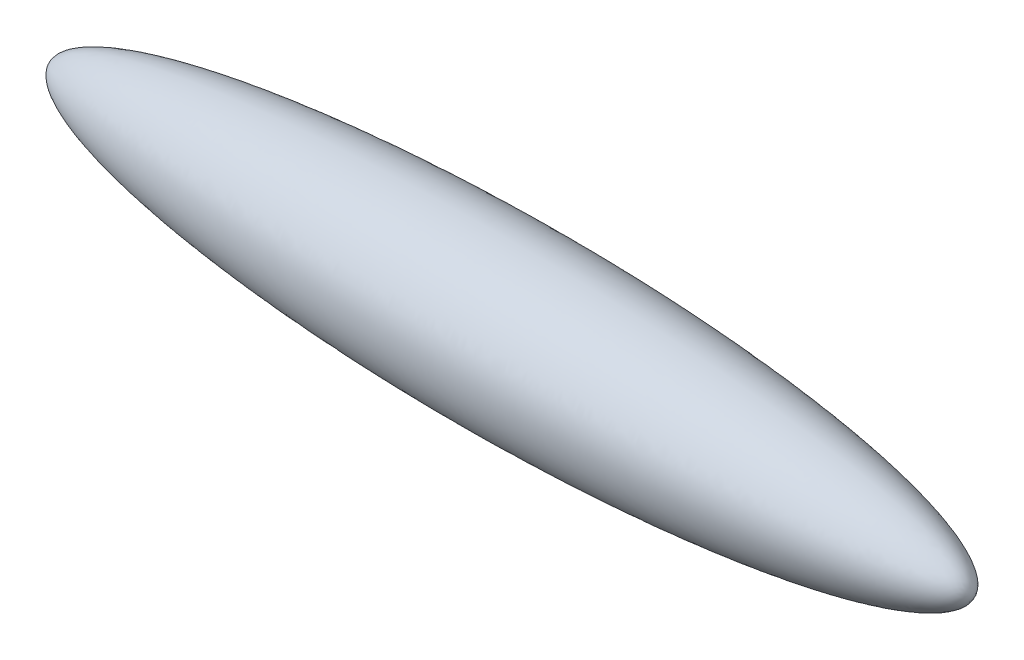
ISO-10303-21;
HEADER;
FILE_DESCRIPTION(('STEP AP214'),'2;1');
FILE_NAME('part.step','',(''),(''),'','','');
FILE_SCHEMA(('AUTOMOTIVE_DESIGN { 1 0 10303 214 1 1 1 1 }'));
ENDSEC;
DATA;
#1=APPLICATION_CONTEXT('core data for automotive mechanical design processes');
#2=APPLICATION_PROTOCOL_DEFINITION('international standard','automotive_design',2000,#1);
#3=PRODUCT_CONTEXT('',#1,'mechanical');
#4=PRODUCT('Part','Part','',(#3));
#5=PRODUCT_RELATED_PRODUCT_CATEGORY('part','',(#4));
#6=PRODUCT_DEFINITION_FORMATION('','',#4);
#7=PRODUCT_DEFINITION_CONTEXT('part definition',#1,'design');
#8=PRODUCT_DEFINITION('design','',#6,#7);
#9=PRODUCT_DEFINITION_SHAPE('','',#8);
#10=(LENGTH_UNIT() NAMED_UNIT(*) SI_UNIT(.MILLI.,.METRE.));
#11=(NAMED_UNIT(*) PLANE_ANGLE_UNIT() SI_UNIT($,.RADIAN.));
#12=(NAMED_UNIT(*) SI_UNIT($,.STERADIAN.) SOLID_ANGLE_UNIT());
#13=UNCERTAINTY_MEASURE_WITH_UNIT(LENGTH_MEASURE(1.E-05),#10,'distance_accuracy_value','');
#14=(GEOMETRIC_REPRESENTATION_CONTEXT(3) GLOBAL_UNCERTAINTY_ASSIGNED_CONTEXT((#13)) GLOBAL_UNIT_ASSIGNED_CONTEXT((#10,
#11,#12)) REPRESENTATION_CONTEXT('',''));
#15=CARTESIAN_POINT('',(0.,0.,0.));
#16=DIRECTION('',(0.,0.,1.));
#17=DIRECTION('',(1.,0.,0.));
#18=AXIS2_PLACEMENT_3D('',#15,#16,#17);
#19=CARTESIAN_POINT('',(686.,0.,0.));
#20=CARTESIAN_POINT('',(685.999583237581,0.927345764858918,0.));
#21=CARTESIAN_POINT('',(685.880472014481,2.7737555838857,0.));
#22=CARTESIAN_POINT('',(685.255795290256,5.94879036893803,0.));
#23=CARTESIAN_POINT('',(683.293703085743,10.6436013785347,0.));
#24=CARTESIAN_POINT('',(679.184258234768,16.630287224147,0.));
#25=CARTESIAN_POINT('',(672.447558278924,23.0428817181101,0.));
#26=CARTESIAN_POINT('',(663.568013972002,29.294829113718,0.));
#27=CARTESIAN_POINT('',(653.19201971855,35.1119627469702,0.));
#28=CARTESIAN_POINT('',(642.633562680417,40.1257689271645,0.));
#29=CARTESIAN_POINT('',(631.908534662679,44.5841711975545,0.));
#30=CARTESIAN_POINT('',(621.095326866427,48.6079511349039,0.));
#31=CARTESIAN_POINT('',(610.029472282556,52.347214335309,0.));
#32=CARTESIAN_POINT('',(598.737039083184,55.8452126664585,0.));
#33=CARTESIAN_POINT('',(584.323796602967,59.9672671867766,0.));
#34=CARTESIAN_POINT('',(566.742409682658,64.5180633481482,0.));
#35=CARTESIAN_POINT('',(546.101772652312,69.301956885524,0.));
#36=CARTESIAN_POINT('',(522.386695381151,74.189861345745,0.));
#37=CARTESIAN_POINT('',(498.57805435133,78.5964472415831,0.));
#38=CARTESIAN_POINT('',(468.727078307575,83.5905406828583,0.));
#39=CARTESIAN_POINT('',(432.792221758579,88.8675004211088,0.));
#40=CARTESIAN_POINT('',(390.74949657261,94.1545511872709,0.));
#41=CARTESIAN_POINT('',(342.587514383882,99.2061389894259,0.));
#42=CARTESIAN_POINT('',(294.344243628902,103.403079917535,0.));
#43=CARTESIAN_POINT('',(246.041292806964,106.840204399108,0.));
#44=CARTESIAN_POINT('',(197.694372145935,109.585271973572,0.));
#45=CARTESIAN_POINT('',(149.315361086214,111.686766520259,0.));
#46=CARTESIAN_POINT('',(100.913873713332,113.178821857933,0.));
#47=CARTESIAN_POINT('',(40.3938896206913,114.310672933354,0.));
#48=CARTESIAN_POINT('',(-32.2445612146426,114.522208897865,0.));
#49=CARTESIAN_POINT('',(-116.981559032428,113.117931930731,0.));
#50=CARTESIAN_POINT('',(-201.660305626956,109.650376096542,0.));
#51=CARTESIAN_POINT('',(-274.155387503891,105.048133493621,0.));
#52=CARTESIAN_POINT('',(-334.473780950864,99.9693731210813,0.));
#53=CARTESIAN_POINT('',(-382.651255973501,95.06955419203,0.));
#54=CARTESIAN_POINT('',(-424.713188921984,89.9389657280541,0.));
#55=CARTESIAN_POINT('',(-460.670795159806,84.821001906934,0.));
#56=CARTESIAN_POINT('',(-487.559894738217,80.4678970144173,0.));
#57=CARTESIAN_POINT('',(-505.444364816809,77.3207683736407,0.));
#58=CARTESIAN_POINT('',(-523.288567451099,73.9541238128822,0.));
#59=CARTESIAN_POINT('',(-539.929097146669,70.5832340628961,0.));
#60=CARTESIAN_POINT('',(-558.31083983964,66.5220308301214,0.));
#61=CARTESIAN_POINT('',(-578.381515848851,61.5763236333785,0.));
#62=CARTESIAN_POINT('',(-597.172158599712,56.398452231696,0.));
#63=CARTESIAN_POINT('',(-615.523227490174,50.653539592094,0.));
#64=CARTESIAN_POINT('',(-631.185543210531,44.9635985912122,0.));
#65=CARTESIAN_POINT('',(-643.103479576963,39.9133180561978,0.));
#66=CARTESIAN_POINT('',(-651.39939297974,35.8921924687361,0.));
#67=CARTESIAN_POINT('',(-657.43178942658,32.6985991129952,0.));
#68=CARTESIAN_POINT('',(-663.257218729535,29.3090165879267,0.));
#69=CARTESIAN_POINT('',(-668.924248848208,25.5245283757255,0.));
#70=CARTESIAN_POINT('',(-674.290075567745,21.205508482687,0.));
#71=CARTESIAN_POINT('',(-678.72826458598,16.7961652966475,0.));
#72=CARTESIAN_POINT('',(-681.9682958779,12.712931397554,0.));
#73=CARTESIAN_POINT('',(-684.262827900067,8.60487374554483,0.));
#74=CARTESIAN_POINT('',(-685.556497470058,4.63796552344693,0.));
#75=CARTESIAN_POINT('',(-685.931521706796,2.09421811346278,0.));
#76=CARTESIAN_POINT('',(-685.999699840622,0.699762326128103,0.));
#77=CARTESIAN_POINT('',(-686.,0.,0.));
#78=B_SPLINE_CURVE_WITH_KNOTS('',4,(#19,#20,#21,#22,#23,#24,#25,#26,#27,#28,#29,#30,#31,#32,#33,
#34,#35,#36,#37,#38,#39,#40,#41,#42,#43,#44,#45,#46,#47,#48,#49,#50,#51,#52,#53,#54,#55,#56,#57,
#58,#59,#60,#61,#62,#63,#64,#65,#66,#67,#68,#69,#70,#71,#72,#73,#74,#75,#76,#77),.UNSPECIFIED.,
.F.,.F.,(5,1,1,1,1,1,1,1,1,1,1,1,1,1,1,1,1,1,1,1,1,1,1,1,1,1,1,1,1,1,1,1,1,1,1,1,1,1,1,1,1,1,1,
1,1,1,1,1,1,1,1,1,1,1,1,5),(0.,0.00259912132361717,0.00519824264723445,0.00903540222788757,
0.0142056892689042,0.0228608262327736,0.0311730988737708,0.0394853715147679,0.0475898943768305,
0.0556944172388931,0.0637989401009557,0.0719034629630182,0.0804081359318558,0.0889128089006934,
0.105922154838369,0.122931500776044,0.139940846713719,0.15695020877757,0.173959570841421,
0.207978294969123,0.241997028644023,0.276015762318922,0.31003449450757,0.344053226696218,
0.378071959148272,0.412090691600325,0.446109424329906,0.480128157059487,0.548165622458245,
0.616203089268798,0.684240552079647,0.718259285043049,0.752278018006451,0.78629675027589,
0.820315482545328,0.837324841121144,0.85433419969696,0.862838878984868,0.871343558272776,
0.888352916848592,0.902043839931168,0.915734763013743,0.929425686096318,0.943116609178894,
0.956066507836166,0.962541457164802,0.96577893182912,0.969016406493438,0.975244946481191,
0.981473486468945,0.984906299457054,0.988339112445164,0.992798850603381,0.996076557593521,
0.998038278796761,1.),.UNSPECIFIED.);
#79=CARTESIAN_POINT('',(4.57390534435914,0.,0.));
#80=DIRECTION('',(1.,0.,0.));
#81=AXIS1_PLACEMENT('',#79,#80);
#82=SURFACE_OF_REVOLUTION('',#78,#81);
#83=CARTESIAN_POINT('',(-686.,0.,0.));
#84=VERTEX_POINT('',#83);
#85=VERTEX_LOOP('',#84);
#86=FACE_BOUND('',#85,.T.);
#87=CARTESIAN_POINT('',(686.,0.,0.));
#88=VERTEX_POINT('',#87);
#89=VERTEX_LOOP('',#88);
#90=FACE_BOUND('',#89,.T.);
#91=ADVANCED_FACE('F32',(#86,#90),#82,.F.);
#92=CLOSED_SHELL('',(#91));
#93=MANIFOLD_SOLID_BREP('B2',#92);
#94=ADVANCED_BREP_SHAPE_REPRESENTATION('',(#18,#93),#14);
#95=SHAPE_DEFINITION_REPRESENTATION(#9,#94);
ENDSEC;
END-ISO-10303-21;
